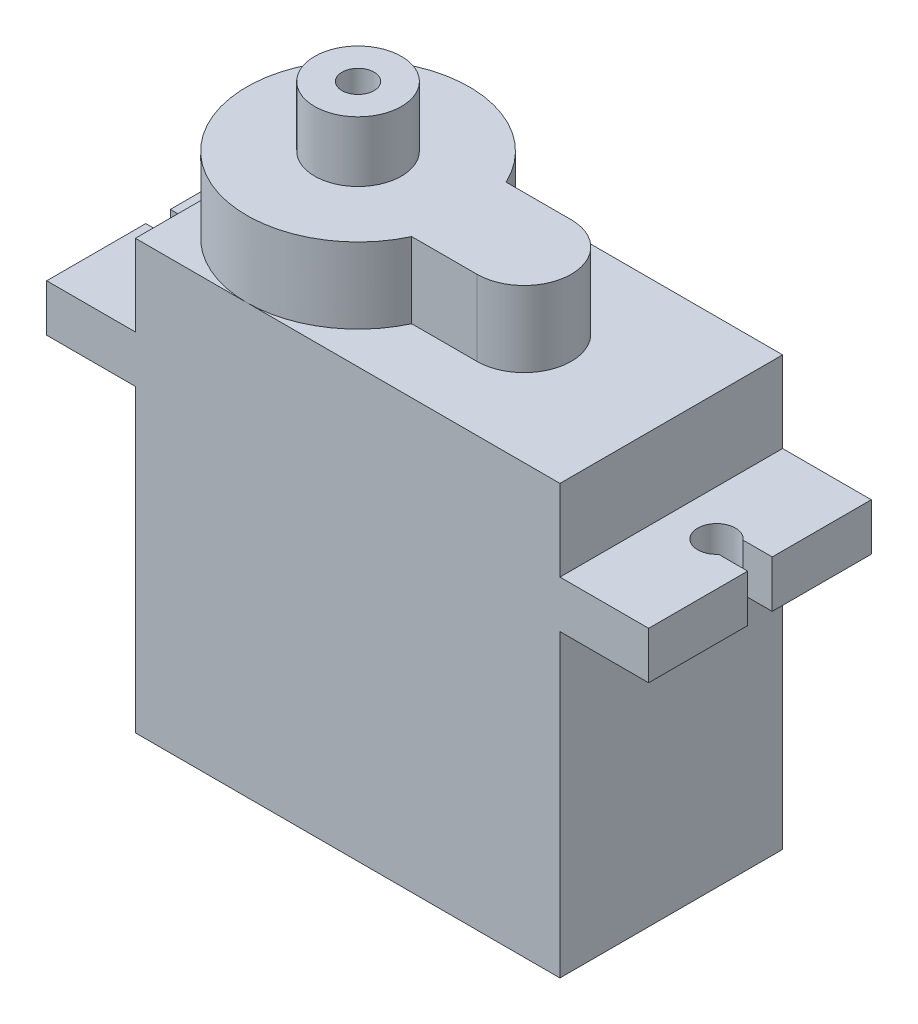
ISO-10303-21;
HEADER;
FILE_DESCRIPTION(('STEP AP214'),'2;1');
FILE_NAME('part.step','',(''),(''),'','','');
FILE_SCHEMA(('AUTOMOTIVE_DESIGN { 1 0 10303 214 1 1 1 1 }'));
ENDSEC;
DATA;
#1=APPLICATION_CONTEXT('core data for automotive mechanical design processes');
#2=APPLICATION_PROTOCOL_DEFINITION('international standard','automotive_design',2000,#1);
#3=PRODUCT_CONTEXT('',#1,'mechanical');
#4=PRODUCT('Part','Part','',(#3));
#5=PRODUCT_RELATED_PRODUCT_CATEGORY('part','',(#4));
#6=PRODUCT_DEFINITION_FORMATION('','',#4);
#7=PRODUCT_DEFINITION_CONTEXT('part definition',#1,'design');
#8=PRODUCT_DEFINITION('design','',#6,#7);
#9=PRODUCT_DEFINITION_SHAPE('','',#8);
#10=(LENGTH_UNIT() NAMED_UNIT(*) SI_UNIT(.MILLI.,.METRE.));
#11=(NAMED_UNIT(*) PLANE_ANGLE_UNIT() SI_UNIT($,.RADIAN.));
#12=(NAMED_UNIT(*) SI_UNIT($,.STERADIAN.) SOLID_ANGLE_UNIT());
#13=UNCERTAINTY_MEASURE_WITH_UNIT(LENGTH_MEASURE(1.E-05),#10,'distance_accuracy_value','');
#14=(GEOMETRIC_REPRESENTATION_CONTEXT(3) GLOBAL_UNCERTAINTY_ASSIGNED_CONTEXT((#13)) GLOBAL_UNIT_ASSIGNED_CONTEXT((#10,
#11,#12)) REPRESENTATION_CONTEXT('',''));
#15=CARTESIAN_POINT('',(0.,0.,0.));
#16=DIRECTION('',(0.,0.,1.));
#17=DIRECTION('',(1.,0.,0.));
#18=AXIS2_PLACEMENT_3D('',#15,#16,#17);
#19=CARTESIAN_POINT('',(11.25,11.35,5.9));
#20=DIRECTION('',(0.,-1.,0.));
#21=DIRECTION('',(1.,0.,0.));
#22=AXIS2_PLACEMENT_3D('',#19,#20,#21);
#23=PLANE('',#22);
#24=CARTESIAN_POINT('',(-5.35,11.35,0.));
#25=DIRECTION('',(0.,1.,0.));
#26=DIRECTION('',(-1.,0.,0.));
#27=AXIS2_PLACEMENT_3D('',#24,#25,#26);
#28=CIRCLE('',#27,5.9);
#29=CARTESIAN_POINT('',(-11.25,11.35,0.));
#30=VERTEX_POINT('',#29);
#31=CARTESIAN_POINT('',(-5.35,11.35,5.9));
#32=VERTEX_POINT('',#31);
#33=EDGE_CURVE('E40',#30,#32,#28,.T.);
#34=ORIENTED_EDGE('',*,*,#33,.F.);
#35=DIRECTION('',(0.,0.,-1.));
#36=VECTOR('',#35,1.);
#37=CARTESIAN_POINT('',(-11.25,11.35,5.9));
#38=LINE('',#37,#36);
#39=CARTESIAN_POINT('',(-11.25,11.35,5.9));
#40=VERTEX_POINT('',#39);
#41=EDGE_CURVE('E374',#40,#30,#38,.T.);
#42=ORIENTED_EDGE('',*,*,#41,.F.);
#43=DIRECTION('',(-1.,0.,0.));
#44=VECTOR('',#43,1.);
#45=CARTESIAN_POINT('',(11.25,11.35,5.9));
#46=LINE('',#45,#44);
#47=EDGE_CURVE('E356',#32,#40,#46,.T.);
#48=ORIENTED_EDGE('',*,*,#47,.F.);
#49=EDGE_LOOP('',(#34,#42,#48));
#50=FACE_BOUND('',#49,.T.);
#51=ADVANCED_FACE('F32',(#50),#23,.F.);
#52=CARTESIAN_POINT('',(-0.00584431364504014,11.35,2.5));
#53=VERTEX_POINT('',#52);
#54=EDGE_CURVE('E389',#32,#53,#28,.T.);
#55=ORIENTED_EDGE('',*,*,#54,.F.);
#56=CARTESIAN_POINT('',(11.25,11.35,5.9));
#57=VERTEX_POINT('',#56);
#58=EDGE_CURVE('E357',#57,#32,#46,.T.);
#59=ORIENTED_EDGE('',*,*,#58,.F.);
#60=DIRECTION('',(0.,0.,-1.));
#61=VECTOR('',#60,1.);
#62=CARTESIAN_POINT('',(11.25,11.35,5.9));
#63=LINE('',#62,#61);
#64=CARTESIAN_POINT('',(11.25,11.35,-5.9));
#65=VERTEX_POINT('',#64);
#66=EDGE_CURVE('E377',#57,#65,#63,.T.);
#67=ORIENTED_EDGE('',*,*,#66,.T.);
#68=DIRECTION('',(-1.,0.,0.));
#69=VECTOR('',#68,1.);
#70=CARTESIAN_POINT('',(11.25,11.35,-5.9));
#71=LINE('',#70,#69);
#72=CARTESIAN_POINT('',(-5.35,11.35,-5.9));
#73=VERTEX_POINT('',#72);
#74=EDGE_CURVE('E371',#65,#73,#71,.T.);
#75=ORIENTED_EDGE('',*,*,#74,.T.);
#76=CARTESIAN_POINT('',(-0.00584431364504103,11.35,-2.5));
#77=VERTEX_POINT('',#76);
#78=EDGE_CURVE('E391',#77,#73,#28,.T.);
#79=ORIENTED_EDGE('',*,*,#78,.F.);
#80=DIRECTION('',(-1.,0.,0.));
#81=VECTOR('',#80,1.);
#82=CARTESIAN_POINT('',(3.45,11.35,-2.5));
#83=LINE('',#82,#81);
#84=CARTESIAN_POINT('',(3.45,11.35,-2.5));
#85=VERTEX_POINT('',#84);
#86=EDGE_CURVE('E397',#85,#77,#83,.T.);
#87=ORIENTED_EDGE('',*,*,#86,.F.);
#88=CARTESIAN_POINT('',(3.45,11.35,0.));
#89=DIRECTION('',(0.,1.,0.));
#90=DIRECTION('',(-1.,0.,0.));
#91=AXIS2_PLACEMENT_3D('',#88,#89,#90);
#92=CIRCLE('',#91,2.5);
#93=CARTESIAN_POINT('',(3.45,11.35,2.5));
#94=VERTEX_POINT('',#93);
#95=EDGE_CURVE('E52',#94,#85,#92,.T.);
#96=ORIENTED_EDGE('',*,*,#95,.F.);
#97=DIRECTION('',(1.,0.,0.));
#98=VECTOR('',#97,1.);
#99=CARTESIAN_POINT('',(3.45,11.35,2.5));
#100=LINE('',#99,#98);
#101=EDGE_CURVE('E47',#53,#94,#100,.T.);
#102=ORIENTED_EDGE('',*,*,#101,.F.);
#103=EDGE_LOOP('',(#55,#59,#67,#75,#79,#87,#96,#102));
#104=FACE_BOUND('',#103,.T.);
#105=ADVANCED_FACE('F417',(#104),#23,.F.);
#106=EDGE_CURVE('E384',#73,#30,#28,.T.);
#107=ORIENTED_EDGE('',*,*,#106,.F.);
#108=CARTESIAN_POINT('',(-11.25,11.35,-5.9));
#109=VERTEX_POINT('',#108);
#110=EDGE_CURVE('E370',#73,#109,#71,.T.);
#111=ORIENTED_EDGE('',*,*,#110,.T.);
#112=EDGE_CURVE('E360',#30,#109,#38,.T.);
#113=ORIENTED_EDGE('',*,*,#112,.F.);
#114=EDGE_LOOP('',(#107,#111,#113));
#115=FACE_BOUND('',#114,.T.);
#116=ADVANCED_FACE('F408',(#115),#23,.F.);
#117=CARTESIAN_POINT('',(-11.25,-11.35,5.9));
#118=DIRECTION('',(1.,0.,0.));
#119=DIRECTION('',(0.,0.,-1.));
#120=AXIS2_PLACEMENT_3D('',#117,#118,#119);
#121=PLANE('',#120);
#122=DIRECTION('',(0.,0.,1.));
#123=VECTOR('',#122,1.);
#124=CARTESIAN_POINT('',(-11.25,4.55,5.9));
#125=LINE('',#124,#123);
#126=CARTESIAN_POINT('',(-11.25,4.55,-5.9));
#127=VERTEX_POINT('',#126);
#128=CARTESIAN_POINT('',(-11.25,4.55,5.9));
#129=VERTEX_POINT('',#128);
#130=EDGE_CURVE('E222',#127,#129,#125,.T.);
#131=ORIENTED_EDGE('',*,*,#130,.F.);
#132=DIRECTION('',(0.,-1.,0.));
#133=VECTOR('',#132,1.);
#134=CARTESIAN_POINT('',(-11.25,-11.35,-5.9));
#135=LINE('',#134,#133);
#136=CARTESIAN_POINT('',(-11.25,-11.35,-5.9));
#137=VERTEX_POINT('',#136);
#138=EDGE_CURVE('E336',#127,#137,#135,.T.);
#139=ORIENTED_EDGE('',*,*,#138,.T.);
#140=DIRECTION('',(0.,0.,-1.));
#141=VECTOR('',#140,1.);
#142=CARTESIAN_POINT('',(-11.25,-11.35,5.9));
#143=LINE('',#142,#141);
#144=CARTESIAN_POINT('',(-11.25,-11.35,5.9));
#145=VERTEX_POINT('',#144);
#146=EDGE_CURVE('E382',#145,#137,#143,.T.);
#147=ORIENTED_EDGE('',*,*,#146,.F.);
#148=DIRECTION('',(0.,-1.,0.));
#149=VECTOR('',#148,1.);
#150=CARTESIAN_POINT('',(-11.25,-11.35,5.9));
#151=LINE('',#150,#149);
#152=EDGE_CURVE('E350',#129,#145,#151,.T.);
#153=ORIENTED_EDGE('',*,*,#152,.F.);
#154=EDGE_LOOP('',(#131,#139,#147,#153));
#155=FACE_BOUND('',#154,.T.);
#156=ADVANCED_FACE('F442',(#155),#121,.F.);
#157=CARTESIAN_POINT('',(11.25,-11.35,5.9));
#158=DIRECTION('',(-1.,0.,0.));
#159=DIRECTION('',(0.,0.,1.));
#160=AXIS2_PLACEMENT_3D('',#157,#158,#159);
#161=PLANE('',#160);
#162=DIRECTION('',(0.,0.,-1.));
#163=VECTOR('',#162,1.);
#164=CARTESIAN_POINT('',(11.25,4.55000000000001,5.9));
#165=LINE('',#164,#163);
#166=CARTESIAN_POINT('',(11.25,4.55000000000001,5.9));
#167=VERTEX_POINT('',#166);
#168=CARTESIAN_POINT('',(11.25,4.55000000000001,-5.9));
#169=VERTEX_POINT('',#168);
#170=EDGE_CURVE('E277',#167,#169,#165,.T.);
#171=ORIENTED_EDGE('',*,*,#170,.F.);
#172=DIRECTION('',(0.,1.,0.));
#173=VECTOR('',#172,1.);
#174=CARTESIAN_POINT('',(11.25,-11.35,5.9));
#175=LINE('',#174,#173);
#176=CARTESIAN_POINT('',(11.25,-11.35,5.9));
#177=VERTEX_POINT('',#176);
#178=EDGE_CURVE('E353',#177,#167,#175,.T.);
#179=ORIENTED_EDGE('',*,*,#178,.F.);
#180=DIRECTION('',(0.,0.,-1.));
#181=VECTOR('',#180,1.);
#182=CARTESIAN_POINT('',(11.25,-11.35,5.9));
#183=LINE('',#182,#181);
#184=CARTESIAN_POINT('',(11.25,-11.35,-5.9));
#185=VERTEX_POINT('',#184);
#186=EDGE_CURVE('E380',#177,#185,#183,.T.);
#187=ORIENTED_EDGE('',*,*,#186,.T.);
#188=DIRECTION('',(0.,1.,0.));
#189=VECTOR('',#188,1.);
#190=CARTESIAN_POINT('',(11.25,-11.35,-5.9));
#191=LINE('',#190,#189);
#192=EDGE_CURVE('E367',#185,#169,#191,.T.);
#193=ORIENTED_EDGE('',*,*,#192,.T.);
#194=EDGE_LOOP('',(#171,#179,#187,#193));
#195=FACE_BOUND('',#194,.T.);
#196=ADVANCED_FACE('F450',(#195),#161,.F.);
#197=CARTESIAN_POINT('',(-11.25,7.05,-5.9));
#198=VERTEX_POINT('',#197);
#199=EDGE_CURVE('E361',#109,#198,#135,.T.);
#200=ORIENTED_EDGE('',*,*,#199,.T.);
#201=DIRECTION('',(0.,0.,1.));
#202=VECTOR('',#201,1.);
#203=CARTESIAN_POINT('',(-11.25,7.05,5.9));
#204=LINE('',#203,#202);
#205=CARTESIAN_POINT('',(-11.25,7.05,5.9));
#206=VERTEX_POINT('',#205);
#207=EDGE_CURVE('E231',#198,#206,#204,.T.);
#208=ORIENTED_EDGE('',*,*,#207,.T.);
#209=EDGE_CURVE('E346',#40,#206,#151,.T.);
#210=ORIENTED_EDGE('',*,*,#209,.F.);
#211=ORIENTED_EDGE('',*,*,#41,.T.);
#212=ORIENTED_EDGE('',*,*,#112,.T.);
#213=EDGE_LOOP('',(#200,#208,#210,#211,#212));
#214=FACE_BOUND('',#213,.T.);
#215=ADVANCED_FACE('F34',(#214),#121,.F.);
#216=CARTESIAN_POINT('',(11.25,-11.35,5.9));
#217=DIRECTION('',(0.,1.,0.));
#218=DIRECTION('',(-1.,0.,0.));
#219=AXIS2_PLACEMENT_3D('',#216,#217,#218);
#220=PLANE('',#219);
#221=DIRECTION('',(1.,0.,0.));
#222=VECTOR('',#221,1.);
#223=CARTESIAN_POINT('',(11.25,-11.35,-5.9));
#224=LINE('',#223,#222);
#225=EDGE_CURVE('E364',#137,#185,#224,.T.);
#226=ORIENTED_EDGE('',*,*,#225,.T.);
#227=ORIENTED_EDGE('',*,*,#186,.F.);
#228=DIRECTION('',(1.,0.,0.));
#229=VECTOR('',#228,1.);
#230=CARTESIAN_POINT('',(11.25,-11.35,5.9));
#231=LINE('',#230,#229);
#232=EDGE_CURVE('E349',#145,#177,#231,.T.);
#233=ORIENTED_EDGE('',*,*,#232,.F.);
#234=ORIENTED_EDGE('',*,*,#146,.T.);
#235=EDGE_LOOP('',(#226,#227,#233,#234));
#236=FACE_BOUND('',#235,.T.);
#237=ADVANCED_FACE('F446',(#236),#220,.F.);
#238=CARTESIAN_POINT('',(11.25,7.05000000000001,5.9));
#239=VERTEX_POINT('',#238);
#240=EDGE_CURVE('E352',#239,#57,#175,.T.);
#241=ORIENTED_EDGE('',*,*,#240,.F.);
#242=DIRECTION('',(0.,0.,-1.));
#243=VECTOR('',#242,1.);
#244=CARTESIAN_POINT('',(11.25,7.05000000000001,5.9));
#245=LINE('',#244,#243);
#246=CARTESIAN_POINT('',(11.25,7.05000000000001,-5.9));
#247=VERTEX_POINT('',#246);
#248=EDGE_CURVE('E287',#239,#247,#245,.T.);
#249=ORIENTED_EDGE('',*,*,#248,.T.);
#250=EDGE_CURVE('E366',#247,#65,#191,.T.);
#251=ORIENTED_EDGE('',*,*,#250,.T.);
#252=ORIENTED_EDGE('',*,*,#66,.F.);
#253=EDGE_LOOP('',(#241,#249,#251,#252));
#254=FACE_BOUND('',#253,.T.);
#255=ADVANCED_FACE('F463',(#254),#161,.F.);
#256=CARTESIAN_POINT('',(0.,0.,5.9));
#257=DIRECTION('',(0.,0.,1.));
#258=DIRECTION('',(1.,0.,0.));
#259=AXIS2_PLACEMENT_3D('',#256,#257,#258);
#260=PLANE('',#259);
#261=ORIENTED_EDGE('',*,*,#209,.T.);
#262=DIRECTION('',(-1.,0.,0.));
#263=VECTOR('',#262,1.);
#264=CARTESIAN_POINT('',(-11.25,7.05,5.9));
#265=LINE('',#264,#263);
#266=CARTESIAN_POINT('',(-15.95,7.05,5.9));
#267=VERTEX_POINT('',#266);
#268=EDGE_CURVE('E234',#206,#267,#265,.T.);
#269=ORIENTED_EDGE('',*,*,#268,.T.);
#270=DIRECTION('',(0.,-1.,0.));
#271=VECTOR('',#270,1.);
#272=CARTESIAN_POINT('',(-15.95,7.05,5.9));
#273=LINE('',#272,#271);
#274=CARTESIAN_POINT('',(-15.95,4.55,5.9));
#275=VERTEX_POINT('',#274);
#276=EDGE_CURVE('E255',#267,#275,#273,.T.);
#277=ORIENTED_EDGE('',*,*,#276,.T.);
#278=DIRECTION('',(-1.,0.,0.));
#279=VECTOR('',#278,1.);
#280=CARTESIAN_POINT('',(-11.25,4.55,5.9));
#281=LINE('',#280,#279);
#282=EDGE_CURVE('E225',#129,#275,#281,.T.);
#283=ORIENTED_EDGE('',*,*,#282,.F.);
#284=ORIENTED_EDGE('',*,*,#152,.T.);
#285=ORIENTED_EDGE('',*,*,#232,.T.);
#286=ORIENTED_EDGE('',*,*,#178,.T.);
#287=DIRECTION('',(-1.,0.,0.));
#288=VECTOR('',#287,1.);
#289=CARTESIAN_POINT('',(11.25,4.55000000000001,5.9));
#290=LINE('',#289,#288);
#291=CARTESIAN_POINT('',(15.95,4.55000000000001,5.9));
#292=VERTEX_POINT('',#291);
#293=EDGE_CURVE('E291',#292,#167,#290,.T.);
#294=ORIENTED_EDGE('',*,*,#293,.F.);
#295=DIRECTION('',(0.,-1.,0.));
#296=VECTOR('',#295,1.);
#297=CARTESIAN_POINT('',(15.95,7.05000000000001,5.9));
#298=LINE('',#297,#296);
#299=CARTESIAN_POINT('',(15.95,7.05000000000001,5.9));
#300=VERTEX_POINT('',#299);
#301=EDGE_CURVE('E334',#300,#292,#298,.T.);
#302=ORIENTED_EDGE('',*,*,#301,.F.);
#303=DIRECTION('',(-1.,0.,0.));
#304=VECTOR('',#303,1.);
#305=CARTESIAN_POINT('',(11.25,7.05000000000001,5.9));
#306=LINE('',#305,#304);
#307=EDGE_CURVE('E309',#300,#239,#306,.T.);
#308=ORIENTED_EDGE('',*,*,#307,.T.);
#309=ORIENTED_EDGE('',*,*,#240,.T.);
#310=ORIENTED_EDGE('',*,*,#58,.T.);
#311=ORIENTED_EDGE('',*,*,#47,.T.);
#312=EDGE_LOOP('',(#261,#269,#277,#283,#284,#285,#286,#294,#302,#308,#309,#310,#311));
#313=FACE_BOUND('',#312,.T.);
#314=ADVANCED_FACE('F413',(#313),#260,.T.);
#315=CARTESIAN_POINT('',(0.,0.,-5.9));
#316=DIRECTION('',(0.,0.,1.));
#317=DIRECTION('',(1.,0.,0.));
#318=AXIS2_PLACEMENT_3D('',#315,#316,#317);
#319=PLANE('',#318);
#320=ORIENTED_EDGE('',*,*,#199,.F.);
#321=ORIENTED_EDGE('',*,*,#110,.F.);
#322=ORIENTED_EDGE('',*,*,#74,.F.);
#323=ORIENTED_EDGE('',*,*,#250,.F.);
#324=DIRECTION('',(1.,0.,0.));
#325=VECTOR('',#324,1.);
#326=CARTESIAN_POINT('',(11.25,7.05000000000001,-5.9));
#327=LINE('',#326,#325);
#328=CARTESIAN_POINT('',(15.95,7.05000000000001,-5.9));
#329=VERTEX_POINT('',#328);
#330=EDGE_CURVE('E290',#247,#329,#327,.T.);
#331=ORIENTED_EDGE('',*,*,#330,.T.);
#332=DIRECTION('',(0.,-1.,0.));
#333=VECTOR('',#332,1.);
#334=CARTESIAN_POINT('',(15.95,7.05000000000001,-5.9));
#335=LINE('',#334,#333);
#336=CARTESIAN_POINT('',(15.95,4.55000000000001,-5.9));
#337=VERTEX_POINT('',#336);
#338=EDGE_CURVE('E312',#329,#337,#335,.T.);
#339=ORIENTED_EDGE('',*,*,#338,.T.);
#340=DIRECTION('',(1.,0.,0.));
#341=VECTOR('',#340,1.);
#342=CARTESIAN_POINT('',(11.25,4.55000000000001,-5.9));
#343=LINE('',#342,#341);
#344=EDGE_CURVE('E315',#169,#337,#343,.T.);
#345=ORIENTED_EDGE('',*,*,#344,.F.);
#346=ORIENTED_EDGE('',*,*,#192,.F.);
#347=ORIENTED_EDGE('',*,*,#225,.F.);
#348=ORIENTED_EDGE('',*,*,#138,.F.);
#349=DIRECTION('',(1.,0.,0.));
#350=VECTOR('',#349,1.);
#351=CARTESIAN_POINT('',(-11.25,4.55,-5.9));
#352=LINE('',#351,#350);
#353=CARTESIAN_POINT('',(-15.95,4.55,-5.9));
#354=VERTEX_POINT('',#353);
#355=EDGE_CURVE('E235',#354,#127,#352,.T.);
#356=ORIENTED_EDGE('',*,*,#355,.F.);
#357=DIRECTION('',(0.,-1.,0.));
#358=VECTOR('',#357,1.);
#359=CARTESIAN_POINT('',(-15.95,7.05,-5.9));
#360=LINE('',#359,#358);
#361=CARTESIAN_POINT('',(-15.95,7.05,-5.9));
#362=VERTEX_POINT('',#361);
#363=EDGE_CURVE('E275',#362,#354,#360,.T.);
#364=ORIENTED_EDGE('',*,*,#363,.F.);
#365=DIRECTION('',(1.,0.,0.));
#366=VECTOR('',#365,1.);
#367=CARTESIAN_POINT('',(-11.25,7.05,-5.9));
#368=LINE('',#367,#366);
#369=EDGE_CURVE('E253',#362,#198,#368,.T.);
#370=ORIENTED_EDGE('',*,*,#369,.T.);
#371=EDGE_LOOP('',(#320,#321,#322,#323,#331,#339,#345,#346,#347,#348,#356,#364,#370));
#372=FACE_BOUND('',#371,.T.);
#373=ADVANCED_FACE('F422',(#372),#319,.F.);
#374=CARTESIAN_POINT('',(15.95,7.05000000000001,5.9));
#375=DIRECTION('',(1.,0.,0.));
#376=DIRECTION('',(0.,1.,0.));
#377=AXIS2_PLACEMENT_3D('',#374,#375,#376);
#378=PLANE('',#377);
#379=DIRECTION('',(0.,0.,1.));
#380=VECTOR('',#379,1.);
#381=CARTESIAN_POINT('',(15.95,4.55000000000001,5.9));
#382=LINE('',#381,#380);
#383=CARTESIAN_POINT('',(15.95,4.55000000000001,0.65));
#384=VERTEX_POINT('',#383);
#385=EDGE_CURVE('E330',#384,#292,#382,.T.);
#386=ORIENTED_EDGE('',*,*,#385,.F.);
#387=DIRECTION('',(0.,-1.,0.));
#388=VECTOR('',#387,1.);
#389=CARTESIAN_POINT('',(15.95,7.05000000000001,0.65));
#390=LINE('',#389,#388);
#391=CARTESIAN_POINT('',(15.95,7.05000000000001,0.65));
#392=VERTEX_POINT('',#391);
#393=EDGE_CURVE('E337',#392,#384,#390,.T.);
#394=ORIENTED_EDGE('',*,*,#393,.F.);
#395=DIRECTION('',(0.,0.,1.));
#396=VECTOR('',#395,1.);
#397=CARTESIAN_POINT('',(15.95,7.05000000000001,5.9));
#398=LINE('',#397,#396);
#399=EDGE_CURVE('E306',#392,#300,#398,.T.);
#400=ORIENTED_EDGE('',*,*,#399,.T.);
#401=ORIENTED_EDGE('',*,*,#301,.T.);
#402=EDGE_LOOP('',(#386,#394,#400,#401));
#403=FACE_BOUND('',#402,.T.);
#404=ADVANCED_FACE('F457',(#403),#378,.T.);
#405=CARTESIAN_POINT('',(15.95,7.05000000000001,0.65));
#406=DIRECTION('',(0.,0.,-1.));
#407=DIRECTION('',(-1.,0.,0.));
#408=AXIS2_PLACEMENT_3D('',#405,#406,#407);
#409=PLANE('',#408);
#410=DIRECTION('',(1.,0.,0.));
#411=VECTOR('',#410,1.);
#412=CARTESIAN_POINT('',(15.95,4.55000000000001,0.65));
#413=LINE('',#412,#411);
#414=CARTESIAN_POINT('',(14.4099342076785,4.55000000000001,0.65));
#415=VERTEX_POINT('',#414);
#416=EDGE_CURVE('E327',#415,#384,#413,.T.);
#417=ORIENTED_EDGE('',*,*,#416,.F.);
#418=DIRECTION('',(0.,-1.,0.));
#419=VECTOR('',#418,1.);
#420=CARTESIAN_POINT('',(14.4099342076785,7.05000000000001,0.65));
#421=LINE('',#420,#419);
#422=CARTESIAN_POINT('',(14.4099342076785,7.05000000000001,0.65));
#423=VERTEX_POINT('',#422);
#424=EDGE_CURVE('E339',#423,#415,#421,.T.);
#425=ORIENTED_EDGE('',*,*,#424,.F.);
#426=DIRECTION('',(1.,0.,0.));
#427=VECTOR('',#426,1.);
#428=CARTESIAN_POINT('',(15.95,7.05000000000001,0.65));
#429=LINE('',#428,#427);
#430=EDGE_CURVE('E303',#423,#392,#429,.T.);
#431=ORIENTED_EDGE('',*,*,#430,.T.);
#432=ORIENTED_EDGE('',*,*,#393,.T.);
#433=EDGE_LOOP('',(#417,#425,#431,#432));
#434=FACE_BOUND('',#433,.T.);
#435=ADVANCED_FACE('F518',(#434),#409,.T.);
#436=CARTESIAN_POINT('',(13.65,7.05000000000001,0.));
#437=DIRECTION('',(0.,-1.,0.));
#438=DIRECTION('',(1.,0.,0.));
#439=AXIS2_PLACEMENT_3D('',#436,#437,#438);
#440=CYLINDRICAL_SURFACE('',#439,0.999999999999997);
#441=CARTESIAN_POINT('',(13.65,4.55000000000001,0.));
#442=DIRECTION('',(0.,1.,0.));
#443=DIRECTION('',(-1.,0.,0.));
#444=AXIS2_PLACEMENT_3D('',#441,#442,#443);
#445=CIRCLE('',#444,0.999999999999997);
#446=CARTESIAN_POINT('',(14.4099342076785,4.55000000000001,-0.65));
#447=VERTEX_POINT('',#446);
#448=EDGE_CURVE('E324',#447,#415,#445,.T.);
#449=ORIENTED_EDGE('',*,*,#448,.F.);
#450=DIRECTION('',(0.,-1.,0.));
#451=VECTOR('',#450,1.);
#452=CARTESIAN_POINT('',(14.4099342076785,7.05000000000001,-0.65));
#453=LINE('',#452,#451);
#454=CARTESIAN_POINT('',(14.4099342076785,7.05000000000001,-0.65));
#455=VERTEX_POINT('',#454);
#456=EDGE_CURVE('E341',#455,#447,#453,.T.);
#457=ORIENTED_EDGE('',*,*,#456,.F.);
#458=CARTESIAN_POINT('',(13.65,7.05000000000001,0.));
#459=DIRECTION('',(0.,1.,0.));
#460=DIRECTION('',(-1.,0.,0.));
#461=AXIS2_PLACEMENT_3D('',#458,#459,#460);
#462=CIRCLE('',#461,0.999999999999997);
#463=EDGE_CURVE('E300',#455,#423,#462,.T.);
#464=ORIENTED_EDGE('',*,*,#463,.T.);
#465=ORIENTED_EDGE('',*,*,#424,.T.);
#466=EDGE_LOOP('',(#449,#457,#464,#465));
#467=FACE_BOUND('',#466,.T.);
#468=ADVANCED_FACE('F529',(#467),#440,.F.);
#469=CARTESIAN_POINT('',(14.4099342076785,7.05000000000001,-0.65));
#470=DIRECTION('',(0.,0.,1.));
#471=DIRECTION('',(1.,0.,0.));
#472=AXIS2_PLACEMENT_3D('',#469,#470,#471);
#473=PLANE('',#472);
#474=DIRECTION('',(-1.,0.,0.));
#475=VECTOR('',#474,1.);
#476=CARTESIAN_POINT('',(14.4099342076785,4.55000000000001,-0.65));
#477=LINE('',#476,#475);
#478=CARTESIAN_POINT('',(15.95,4.55000000000001,-0.65));
#479=VERTEX_POINT('',#478);
#480=EDGE_CURVE('E321',#479,#447,#477,.T.);
#481=ORIENTED_EDGE('',*,*,#480,.F.);
#482=DIRECTION('',(0.,-1.,0.));
#483=VECTOR('',#482,1.);
#484=CARTESIAN_POINT('',(15.95,7.05000000000001,-0.65));
#485=LINE('',#484,#483);
#486=CARTESIAN_POINT('',(15.95,7.05000000000001,-0.65));
#487=VERTEX_POINT('',#486);
#488=EDGE_CURVE('E343',#487,#479,#485,.T.);
#489=ORIENTED_EDGE('',*,*,#488,.F.);
#490=DIRECTION('',(-1.,0.,0.));
#491=VECTOR('',#490,1.);
#492=CARTESIAN_POINT('',(14.4099342076785,7.05000000000001,-0.65));
#493=LINE('',#492,#491);
#494=EDGE_CURVE('E297',#487,#455,#493,.T.);
#495=ORIENTED_EDGE('',*,*,#494,.T.);
#496=ORIENTED_EDGE('',*,*,#456,.T.);
#497=EDGE_LOOP('',(#481,#489,#495,#496));
#498=FACE_BOUND('',#497,.T.);
#499=ADVANCED_FACE('F539',(#498),#473,.T.);
#500=CARTESIAN_POINT('',(15.95,7.05000000000001,-0.65));
#501=DIRECTION('',(1.,0.,0.));
#502=DIRECTION('',(0.,1.,0.));
#503=AXIS2_PLACEMENT_3D('',#500,#501,#502);
#504=PLANE('',#503);
#505=DIRECTION('',(0.,0.,1.));
#506=VECTOR('',#505,1.);
#507=CARTESIAN_POINT('',(15.95,4.55000000000001,-0.65));
#508=LINE('',#507,#506);
#509=EDGE_CURVE('E318',#337,#479,#508,.T.);
#510=ORIENTED_EDGE('',*,*,#509,.F.);
#511=ORIENTED_EDGE('',*,*,#338,.F.);
#512=DIRECTION('',(0.,0.,1.));
#513=VECTOR('',#512,1.);
#514=CARTESIAN_POINT('',(15.95,7.05000000000001,-0.65));
#515=LINE('',#514,#513);
#516=EDGE_CURVE('E294',#329,#487,#515,.T.);
#517=ORIENTED_EDGE('',*,*,#516,.T.);
#518=ORIENTED_EDGE('',*,*,#488,.T.);
#519=EDGE_LOOP('',(#510,#511,#517,#518));
#520=FACE_BOUND('',#519,.T.);
#521=ADVANCED_FACE('F549',(#520),#504,.T.);
#522=CARTESIAN_POINT('',(13.65,7.05000000000001,0.));
#523=DIRECTION('',(0.,1.,0.));
#524=DIRECTION('',(-1.,0.,0.));
#525=AXIS2_PLACEMENT_3D('',#522,#523,#524);
#526=PLANE('',#525);
#527=ORIENTED_EDGE('',*,*,#248,.F.);
#528=ORIENTED_EDGE('',*,*,#307,.F.);
#529=ORIENTED_EDGE('',*,*,#399,.F.);
#530=ORIENTED_EDGE('',*,*,#430,.F.);
#531=ORIENTED_EDGE('',*,*,#463,.F.);
#532=ORIENTED_EDGE('',*,*,#494,.F.);
#533=ORIENTED_EDGE('',*,*,#516,.F.);
#534=ORIENTED_EDGE('',*,*,#330,.F.);
#535=EDGE_LOOP('',(#527,#528,#529,#530,#531,#532,#533,#534));
#536=FACE_BOUND('',#535,.T.);
#537=ADVANCED_FACE('F462',(#536),#526,.T.);
#538=CARTESIAN_POINT('',(13.65,4.55000000000001,0.));
#539=DIRECTION('',(0.,1.,0.));
#540=DIRECTION('',(-1.,0.,0.));
#541=AXIS2_PLACEMENT_3D('',#538,#539,#540);
#542=PLANE('',#541);
#543=ORIENTED_EDGE('',*,*,#170,.T.);
#544=ORIENTED_EDGE('',*,*,#344,.T.);
#545=ORIENTED_EDGE('',*,*,#509,.T.);
#546=ORIENTED_EDGE('',*,*,#480,.T.);
#547=ORIENTED_EDGE('',*,*,#448,.T.);
#548=ORIENTED_EDGE('',*,*,#416,.T.);
#549=ORIENTED_EDGE('',*,*,#385,.T.);
#550=ORIENTED_EDGE('',*,*,#293,.T.);
#551=EDGE_LOOP('',(#543,#544,#545,#546,#547,#548,#549,#550));
#552=FACE_BOUND('',#551,.T.);
#553=ADVANCED_FACE('F453',(#552),#542,.F.);
#554=CARTESIAN_POINT('',(-15.95,7.05,-0.65));
#555=DIRECTION('',(-1.,0.,0.));
#556=DIRECTION('',(0.,0.,1.));
#557=AXIS2_PLACEMENT_3D('',#554,#555,#556);
#558=PLANE('',#557);
#559=DIRECTION('',(0.,0.,-1.));
#560=VECTOR('',#559,1.);
#561=CARTESIAN_POINT('',(-15.95,4.55,-0.65));
#562=LINE('',#561,#560);
#563=CARTESIAN_POINT('',(-15.95,4.55,-0.65));
#564=VERTEX_POINT('',#563);
#565=EDGE_CURVE('E271',#564,#354,#562,.T.);
#566=ORIENTED_EDGE('',*,*,#565,.F.);
#567=DIRECTION('',(0.,-1.,0.));
#568=VECTOR('',#567,1.);
#569=CARTESIAN_POINT('',(-15.95,7.05,-0.65));
#570=LINE('',#569,#568);
#571=CARTESIAN_POINT('',(-15.95,7.05,-0.65));
#572=VERTEX_POINT('',#571);
#573=EDGE_CURVE('E278',#572,#564,#570,.T.);
#574=ORIENTED_EDGE('',*,*,#573,.F.);
#575=DIRECTION('',(0.,0.,-1.));
#576=VECTOR('',#575,1.);
#577=CARTESIAN_POINT('',(-15.95,7.05,-0.65));
#578=LINE('',#577,#576);
#579=EDGE_CURVE('E250',#572,#362,#578,.T.);
#580=ORIENTED_EDGE('',*,*,#579,.T.);
#581=ORIENTED_EDGE('',*,*,#363,.T.);
#582=EDGE_LOOP('',(#566,#574,#580,#581));
#583=FACE_BOUND('',#582,.T.);
#584=ADVANCED_FACE('F576',(#583),#558,.T.);
#585=CARTESIAN_POINT('',(-14.4099342076785,7.05,-0.65));
#586=DIRECTION('',(0.,0.,1.));
#587=DIRECTION('',(1.,0.,0.));
#588=AXIS2_PLACEMENT_3D('',#585,#586,#587);
#589=PLANE('',#588);
#590=DIRECTION('',(-1.,0.,0.));
#591=VECTOR('',#590,1.);
#592=CARTESIAN_POINT('',(-14.4099342076785,4.55,-0.65));
#593=LINE('',#592,#591);
#594=CARTESIAN_POINT('',(-14.4099342076785,4.55,-0.65));
#595=VERTEX_POINT('',#594);
#596=EDGE_CURVE('E268',#595,#564,#593,.T.);
#597=ORIENTED_EDGE('',*,*,#596,.F.);
#598=DIRECTION('',(0.,-1.,0.));
#599=VECTOR('',#598,1.);
#600=CARTESIAN_POINT('',(-14.4099342076785,7.05,-0.65));
#601=LINE('',#600,#599);
#602=CARTESIAN_POINT('',(-14.4099342076785,7.05,-0.65));
#603=VERTEX_POINT('',#602);
#604=EDGE_CURVE('E280',#603,#595,#601,.T.);
#605=ORIENTED_EDGE('',*,*,#604,.F.);
#606=DIRECTION('',(-1.,0.,0.));
#607=VECTOR('',#606,1.);
#608=CARTESIAN_POINT('',(-14.4099342076785,7.05,-0.65));
#609=LINE('',#608,#607);
#610=EDGE_CURVE('E247',#603,#572,#609,.T.);
#611=ORIENTED_EDGE('',*,*,#610,.T.);
#612=ORIENTED_EDGE('',*,*,#573,.T.);
#613=EDGE_LOOP('',(#597,#605,#611,#612));
#614=FACE_BOUND('',#613,.T.);
#615=ADVANCED_FACE('F585',(#614),#589,.T.);
#616=CARTESIAN_POINT('',(-13.65,7.05,0.));
#617=DIRECTION('',(0.,-1.,0.));
#618=DIRECTION('',(1.,0.,0.));
#619=AXIS2_PLACEMENT_3D('',#616,#617,#618);
#620=CYLINDRICAL_SURFACE('',#619,0.999999999999997);
#621=CARTESIAN_POINT('',(-13.65,4.55,0.));
#622=DIRECTION('',(0.,1.,0.));
#623=DIRECTION('',(1.,0.,0.));
#624=AXIS2_PLACEMENT_3D('',#621,#622,#623);
#625=CIRCLE('',#624,0.999999999999997);
#626=CARTESIAN_POINT('',(-14.4099342076785,4.55,0.65));
#627=VERTEX_POINT('',#626);
#628=EDGE_CURVE('E265',#627,#595,#625,.T.);
#629=ORIENTED_EDGE('',*,*,#628,.F.);
#630=DIRECTION('',(0.,-1.,0.));
#631=VECTOR('',#630,1.);
#632=CARTESIAN_POINT('',(-14.4099342076785,7.05,0.65));
#633=LINE('',#632,#631);
#634=CARTESIAN_POINT('',(-14.4099342076785,7.05,0.65));
#635=VERTEX_POINT('',#634);
#636=EDGE_CURVE('E282',#635,#627,#633,.T.);
#637=ORIENTED_EDGE('',*,*,#636,.F.);
#638=CARTESIAN_POINT('',(-13.65,7.05,0.));
#639=DIRECTION('',(0.,1.,0.));
#640=DIRECTION('',(1.,0.,0.));
#641=AXIS2_PLACEMENT_3D('',#638,#639,#640);
#642=CIRCLE('',#641,0.999999999999997);
#643=EDGE_CURVE('E244',#635,#603,#642,.T.);
#644=ORIENTED_EDGE('',*,*,#643,.T.);
#645=ORIENTED_EDGE('',*,*,#604,.T.);
#646=EDGE_LOOP('',(#629,#637,#644,#645));
#647=FACE_BOUND('',#646,.T.);
#648=ADVANCED_FACE('F595',(#647),#620,.F.);
#649=CARTESIAN_POINT('',(-15.95,7.05,0.65));
#650=DIRECTION('',(0.,0.,-1.));
#651=DIRECTION('',(-1.,0.,0.));
#652=AXIS2_PLACEMENT_3D('',#649,#650,#651);
#653=PLANE('',#652);
#654=DIRECTION('',(1.,0.,0.));
#655=VECTOR('',#654,1.);
#656=CARTESIAN_POINT('',(-15.95,4.55,0.65));
#657=LINE('',#656,#655);
#658=CARTESIAN_POINT('',(-15.95,4.55,0.65));
#659=VERTEX_POINT('',#658);
#660=EDGE_CURVE('E262',#659,#627,#657,.T.);
#661=ORIENTED_EDGE('',*,*,#660,.F.);
#662=DIRECTION('',(0.,-1.,0.));
#663=VECTOR('',#662,1.);
#664=CARTESIAN_POINT('',(-15.95,7.05,0.65));
#665=LINE('',#664,#663);
#666=CARTESIAN_POINT('',(-15.95,7.05,0.65));
#667=VERTEX_POINT('',#666);
#668=EDGE_CURVE('E284',#667,#659,#665,.T.);
#669=ORIENTED_EDGE('',*,*,#668,.F.);
#670=DIRECTION('',(1.,0.,0.));
#671=VECTOR('',#670,1.);
#672=CARTESIAN_POINT('',(-15.95,7.05,0.65));
#673=LINE('',#672,#671);
#674=EDGE_CURVE('E241',#667,#635,#673,.T.);
#675=ORIENTED_EDGE('',*,*,#674,.T.);
#676=ORIENTED_EDGE('',*,*,#636,.T.);
#677=EDGE_LOOP('',(#661,#669,#675,#676));
#678=FACE_BOUND('',#677,.T.);
#679=ADVANCED_FACE('F605',(#678),#653,.T.);
#680=CARTESIAN_POINT('',(-15.95,7.05,5.9));
#681=DIRECTION('',(-1.,0.,0.));
#682=DIRECTION('',(0.,0.,1.));
#683=AXIS2_PLACEMENT_3D('',#680,#681,#682);
#684=PLANE('',#683);
#685=DIRECTION('',(0.,0.,-1.));
#686=VECTOR('',#685,1.);
#687=CARTESIAN_POINT('',(-15.95,4.55,5.9));
#688=LINE('',#687,#686);
#689=EDGE_CURVE('E259',#275,#659,#688,.T.);
#690=ORIENTED_EDGE('',*,*,#689,.F.);
#691=ORIENTED_EDGE('',*,*,#276,.F.);
#692=DIRECTION('',(0.,0.,-1.));
#693=VECTOR('',#692,1.);
#694=CARTESIAN_POINT('',(-15.95,7.05,5.9));
#695=LINE('',#694,#693);
#696=EDGE_CURVE('E238',#267,#667,#695,.T.);
#697=ORIENTED_EDGE('',*,*,#696,.T.);
#698=ORIENTED_EDGE('',*,*,#668,.T.);
#699=EDGE_LOOP('',(#690,#691,#697,#698));
#700=FACE_BOUND('',#699,.T.);
#701=ADVANCED_FACE('F434',(#700),#684,.T.);
#702=CARTESIAN_POINT('',(-13.65,7.05,0.));
#703=DIRECTION('',(0.,-1.,0.));
#704=DIRECTION('',(1.,0.,0.));
#705=AXIS2_PLACEMENT_3D('',#702,#703,#704);
#706=PLANE('',#705);
#707=ORIENTED_EDGE('',*,*,#207,.F.);
#708=ORIENTED_EDGE('',*,*,#369,.F.);
#709=ORIENTED_EDGE('',*,*,#579,.F.);
#710=ORIENTED_EDGE('',*,*,#610,.F.);
#711=ORIENTED_EDGE('',*,*,#643,.F.);
#712=ORIENTED_EDGE('',*,*,#674,.F.);
#713=ORIENTED_EDGE('',*,*,#696,.F.);
#714=ORIENTED_EDGE('',*,*,#268,.F.);
#715=EDGE_LOOP('',(#707,#708,#709,#710,#711,#712,#713,#714));
#716=FACE_BOUND('',#715,.T.);
#717=ADVANCED_FACE('F427',(#716),#706,.F.);
#718=CARTESIAN_POINT('',(-13.65,4.55,0.));
#719=DIRECTION('',(0.,-1.,0.));
#720=DIRECTION('',(1.,0.,0.));
#721=AXIS2_PLACEMENT_3D('',#718,#719,#720);
#722=PLANE('',#721);
#723=ORIENTED_EDGE('',*,*,#130,.T.);
#724=ORIENTED_EDGE('',*,*,#282,.T.);
#725=ORIENTED_EDGE('',*,*,#689,.T.);
#726=ORIENTED_EDGE('',*,*,#660,.T.);
#727=ORIENTED_EDGE('',*,*,#628,.T.);
#728=ORIENTED_EDGE('',*,*,#596,.T.);
#729=ORIENTED_EDGE('',*,*,#565,.T.);
#730=ORIENTED_EDGE('',*,*,#355,.T.);
#731=EDGE_LOOP('',(#723,#724,#725,#726,#727,#728,#729,#730));
#732=FACE_BOUND('',#731,.T.);
#733=ADVANCED_FACE('F439',(#732),#722,.T.);
#734=CARTESIAN_POINT('',(3.45,15.35,0.));
#735=DIRECTION('',(0.,-1.,0.));
#736=DIRECTION('',(1.,0.,0.));
#737=AXIS2_PLACEMENT_3D('',#734,#735,#736);
#738=CYLINDRICAL_SURFACE('',#737,2.5);
#739=ORIENTED_EDGE('',*,*,#95,.T.);
#740=DIRECTION('',(0.,-1.,0.));
#741=VECTOR('',#740,1.);
#742=CARTESIAN_POINT('',(3.45,15.35,-2.5));
#743=LINE('',#742,#741);
#744=CARTESIAN_POINT('',(3.45,15.35,-2.5));
#745=VERTEX_POINT('',#744);
#746=EDGE_CURVE('E205',#745,#85,#743,.T.);
#747=ORIENTED_EDGE('',*,*,#746,.F.);
#748=CARTESIAN_POINT('',(3.45,15.35,0.));
#749=DIRECTION('',(0.,1.,0.));
#750=DIRECTION('',(-1.,0.,0.));
#751=AXIS2_PLACEMENT_3D('',#748,#749,#750);
#752=CIRCLE('',#751,2.5);
#753=CARTESIAN_POINT('',(3.45,15.35,2.5));
#754=VERTEX_POINT('',#753);
#755=EDGE_CURVE('E211',#754,#745,#752,.T.);
#756=ORIENTED_EDGE('',*,*,#755,.F.);
#757=DIRECTION('',(0.,-1.,0.));
#758=VECTOR('',#757,1.);
#759=CARTESIAN_POINT('',(3.45,15.35,2.5));
#760=LINE('',#759,#758);
#761=EDGE_CURVE('E774',#754,#94,#760,.T.);
#762=ORIENTED_EDGE('',*,*,#761,.T.);
#763=EDGE_LOOP('',(#739,#747,#756,#762));
#764=FACE_BOUND('',#763,.T.);
#765=ADVANCED_FACE('F221',(#764),#738,.T.);
#766=CARTESIAN_POINT('',(3.45,15.35,-2.5));
#767=DIRECTION('',(0.,0.,1.));
#768=DIRECTION('',(1.,0.,0.));
#769=AXIS2_PLACEMENT_3D('',#766,#767,#768);
#770=PLANE('',#769);
#771=ORIENTED_EDGE('',*,*,#86,.T.);
#772=DIRECTION('',(0.,-1.,0.));
#773=VECTOR('',#772,1.);
#774=CARTESIAN_POINT('',(-0.00584431364504195,15.35,-2.5));
#775=LINE('',#774,#773);
#776=CARTESIAN_POINT('',(-0.00584431364504195,15.35,-2.5));
#777=VERTEX_POINT('',#776);
#778=EDGE_CURVE('E207',#777,#77,#775,.T.);
#779=ORIENTED_EDGE('',*,*,#778,.F.);
#780=DIRECTION('',(-1.,0.,0.));
#781=VECTOR('',#780,1.);
#782=CARTESIAN_POINT('',(3.45,15.35,-2.5));
#783=LINE('',#782,#781);
#784=EDGE_CURVE('E200',#745,#777,#783,.T.);
#785=ORIENTED_EDGE('',*,*,#784,.F.);
#786=ORIENTED_EDGE('',*,*,#746,.T.);
#787=EDGE_LOOP('',(#771,#779,#785,#786));
#788=FACE_BOUND('',#787,.T.);
#789=ADVANCED_FACE('F203',(#788),#770,.F.);
#790=CARTESIAN_POINT('',(-5.35,15.35,0.));
#791=DIRECTION('',(0.,-1.,0.));
#792=DIRECTION('',(1.,0.,0.));
#793=AXIS2_PLACEMENT_3D('',#790,#791,#792);
#794=CYLINDRICAL_SURFACE('',#793,5.9);
#795=ORIENTED_EDGE('',*,*,#78,.T.);
#796=ORIENTED_EDGE('',*,*,#106,.T.);
#797=ORIENTED_EDGE('',*,*,#33,.T.);
#798=ORIENTED_EDGE('',*,*,#54,.T.);
#799=DIRECTION('',(0.,-1.,0.));
#800=VECTOR('',#799,1.);
#801=CARTESIAN_POINT('',(-0.00584431364504106,15.35,2.5));
#802=LINE('',#801,#800);
#803=CARTESIAN_POINT('',(-0.00584431364504106,15.35,2.5));
#804=VERTEX_POINT('',#803);
#805=EDGE_CURVE('E227',#804,#53,#802,.T.);
#806=ORIENTED_EDGE('',*,*,#805,.F.);
#807=CARTESIAN_POINT('',(-5.35,15.35,0.));
#808=DIRECTION('',(0.,1.,0.));
#809=DIRECTION('',(-1.,0.,0.));
#810=AXIS2_PLACEMENT_3D('',#807,#808,#809);
#811=CIRCLE('',#810,5.9);
#812=EDGE_CURVE('E210',#777,#804,#811,.T.);
#813=ORIENTED_EDGE('',*,*,#812,.F.);
#814=ORIENTED_EDGE('',*,*,#778,.T.);
#815=EDGE_LOOP('',(#795,#796,#797,#798,#806,#813,#814));
#816=FACE_BOUND('',#815,.T.);
#817=ADVANCED_FACE('F398',(#816),#794,.T.);
#818=CARTESIAN_POINT('',(3.45,15.35,2.5));
#819=DIRECTION('',(0.,0.,-1.));
#820=DIRECTION('',(-1.,0.,0.));
#821=AXIS2_PLACEMENT_3D('',#818,#819,#820);
#822=PLANE('',#821);
#823=ORIENTED_EDGE('',*,*,#101,.T.);
#824=ORIENTED_EDGE('',*,*,#761,.F.);
#825=DIRECTION('',(1.,0.,0.));
#826=VECTOR('',#825,1.);
#827=CARTESIAN_POINT('',(3.45,15.35,2.5));
#828=LINE('',#827,#826);
#829=EDGE_CURVE('E216',#804,#754,#828,.T.);
#830=ORIENTED_EDGE('',*,*,#829,.F.);
#831=ORIENTED_EDGE('',*,*,#805,.T.);
#832=EDGE_LOOP('',(#823,#824,#830,#831));
#833=FACE_BOUND('',#832,.T.);
#834=ADVANCED_FACE('F678',(#833),#822,.F.);
#835=CARTESIAN_POINT('',(3.45,15.35,0.));
#836=DIRECTION('',(0.,1.,0.));
#837=DIRECTION('',(-1.,0.,0.));
#838=AXIS2_PLACEMENT_3D('',#835,#836,#837);
#839=PLANE('',#838);
#840=CARTESIAN_POINT('',(-5.35,15.35,0.));
#841=DIRECTION('',(0.,1.,0.));
#842=DIRECTION('',(-1.,0.,0.));
#843=AXIS2_PLACEMENT_3D('',#840,#841,#842);
#844=CIRCLE('',#843,2.3);
#845=CARTESIAN_POINT('',(-7.65,15.35,0.));
#846=VERTEX_POINT('',#845);
#847=EDGE_CURVE('E764',#846,#846,#844,.T.);
#848=ORIENTED_EDGE('',*,*,#847,.F.);
#849=EDGE_LOOP('',(#848));
#850=FACE_BOUND('',#849,.T.);
#851=ORIENTED_EDGE('',*,*,#755,.T.);
#852=ORIENTED_EDGE('',*,*,#784,.T.);
#853=ORIENTED_EDGE('',*,*,#812,.T.);
#854=ORIENTED_EDGE('',*,*,#829,.T.);
#855=EDGE_LOOP('',(#851,#852,#853,#854));
#856=FACE_BOUND('',#855,.T.);
#857=ADVANCED_FACE('F214',(#850,#856),#839,.T.);
#858=CARTESIAN_POINT('',(-5.35,18.55,0.));
#859=DIRECTION('',(0.,1.,0.));
#860=DIRECTION('',(-1.,0.,0.));
#861=AXIS2_PLACEMENT_3D('',#858,#859,#860);
#862=PLANE('',#861);
#863=CARTESIAN_POINT('',(-5.35,18.55,0.));
#864=DIRECTION('',(0.,1.,0.));
#865=DIRECTION('',(-1.,0.,0.));
#866=AXIS2_PLACEMENT_3D('',#863,#864,#865);
#867=CIRCLE('',#866,2.3);
#868=CARTESIAN_POINT('',(-7.65,18.55,0.));
#869=VERTEX_POINT('',#868);
#870=EDGE_CURVE('E767',#869,#869,#867,.T.);
#871=ORIENTED_EDGE('',*,*,#870,.T.);
#872=EDGE_LOOP('',(#871));
#873=FACE_BOUND('',#872,.T.);
#874=CARTESIAN_POINT('',(-5.35,18.55,0.));
#875=DIRECTION('',(0.,1.,0.));
#876=DIRECTION('',(-1.,0.,0.));
#877=AXIS2_PLACEMENT_3D('',#874,#875,#876);
#878=CIRCLE('',#877,0.85);
#879=CARTESIAN_POINT('',(-6.2,18.55,0.));
#880=VERTEX_POINT('',#879);
#881=EDGE_CURVE('E761',#880,#880,#878,.T.);
#882=ORIENTED_EDGE('',*,*,#881,.F.);
#883=EDGE_LOOP('',(#882));
#884=FACE_BOUND('',#883,.T.);
#885=ADVANCED_FACE('F694',(#873,#884),#862,.T.);
#886=CARTESIAN_POINT('',(-5.35,18.55,0.));
#887=DIRECTION('',(0.,-1.,0.));
#888=DIRECTION('',(1.,0.,0.));
#889=AXIS2_PLACEMENT_3D('',#886,#887,#888);
#890=CYLINDRICAL_SURFACE('',#889,2.3);
#891=ORIENTED_EDGE('',*,*,#870,.F.);
#892=EDGE_LOOP('',(#891));
#893=FACE_BOUND('',#892,.T.);
#894=ORIENTED_EDGE('',*,*,#847,.T.);
#895=EDGE_LOOP('',(#894));
#896=FACE_BOUND('',#895,.T.);
#897=ADVANCED_FACE('F713',(#893,#896),#890,.T.);
#898=CARTESIAN_POINT('',(-5.35,18.55,0.));
#899=DIRECTION('',(0.,-1.,0.));
#900=DIRECTION('',(1.,0.,0.));
#901=AXIS2_PLACEMENT_3D('',#898,#899,#900);
#902=CYLINDRICAL_SURFACE('',#901,0.85);
#903=ORIENTED_EDGE('',*,*,#881,.T.);
#904=EDGE_LOOP('',(#903));
#905=FACE_BOUND('',#904,.T.);
#906=CARTESIAN_POINT('',(-5.35,15.35,0.));
#907=DIRECTION('',(0.,1.,0.));
#908=DIRECTION('',(-1.,0.,0.));
#909=AXIS2_PLACEMENT_3D('',#906,#907,#908);
#910=CIRCLE('',#909,0.85);
#911=CARTESIAN_POINT('',(-6.2,15.35,0.));
#912=VERTEX_POINT('',#911);
#913=EDGE_CURVE('E11',#912,#912,#910,.F.);
#914=ORIENTED_EDGE('',*,*,#913,.T.);
#915=EDGE_LOOP('',(#914));
#916=FACE_BOUND('',#915,.T.);
#917=ADVANCED_FACE('F705',(#905,#916),#902,.F.);
#918=ORIENTED_EDGE('',*,*,#913,.F.);
#919=EDGE_LOOP('',(#918));
#920=FACE_BOUND('',#919,.T.);
#921=ADVANCED_FACE('F697',(#920),#839,.T.);
#922=CLOSED_SHELL('',(#51,#105,#116,#156,#196,#215,#237,#255,#314,#373,#404,#435,#468,#499,#521,
#537,#553,#584,#615,#648,#679,#701,#717,#733,#765,#789,#817,#834,#857,#885,#897,#917,#921));
#923=MANIFOLD_SOLID_BREP('B2',#922);
#924=ADVANCED_BREP_SHAPE_REPRESENTATION('',(#18,#923),#14);
#925=SHAPE_DEFINITION_REPRESENTATION(#9,#924);
ENDSEC;
END-ISO-10303-21;
